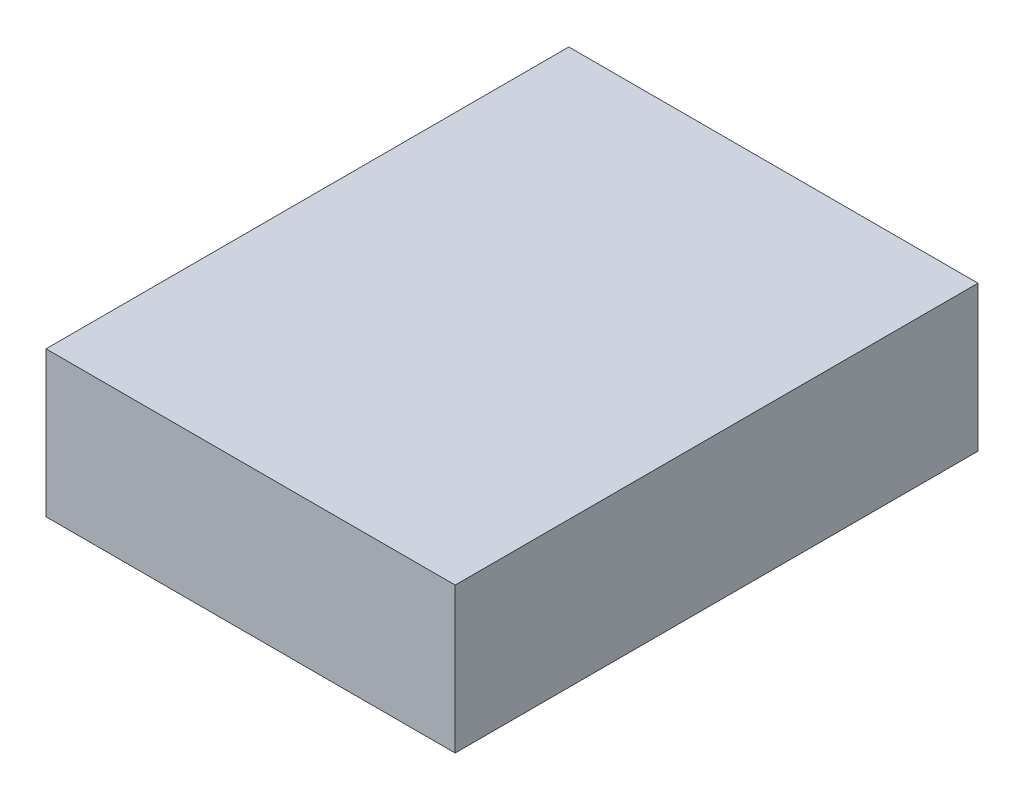
ISO-10303-21;
HEADER;
FILE_DESCRIPTION(('STEP AP214'),'2;1');
FILE_NAME('part.step','',(''),(''),'','','');
FILE_SCHEMA(('AUTOMOTIVE_DESIGN { 1 0 10303 214 1 1 1 1 }'));
ENDSEC;
DATA;
#1=APPLICATION_CONTEXT('core data for automotive mechanical design processes');
#2=APPLICATION_PROTOCOL_DEFINITION('international standard','automotive_design',2000,#1);
#3=PRODUCT_CONTEXT('',#1,'mechanical');
#4=PRODUCT('Part','Part','',(#3));
#5=PRODUCT_RELATED_PRODUCT_CATEGORY('part','',(#4));
#6=PRODUCT_DEFINITION_FORMATION('','',#4);
#7=PRODUCT_DEFINITION_CONTEXT('part definition',#1,'design');
#8=PRODUCT_DEFINITION('design','',#6,#7);
#9=PRODUCT_DEFINITION_SHAPE('','',#8);
#10=(LENGTH_UNIT() NAMED_UNIT(*) SI_UNIT(.MILLI.,.METRE.));
#11=(NAMED_UNIT(*) PLANE_ANGLE_UNIT() SI_UNIT($,.RADIAN.));
#12=(NAMED_UNIT(*) SI_UNIT($,.STERADIAN.) SOLID_ANGLE_UNIT());
#13=UNCERTAINTY_MEASURE_WITH_UNIT(LENGTH_MEASURE(1.E-05),#10,'distance_accuracy_value','');
#14=(GEOMETRIC_REPRESENTATION_CONTEXT(3) GLOBAL_UNCERTAINTY_ASSIGNED_CONTEXT((#13)) GLOBAL_UNIT_ASSIGNED_CONTEXT((#10,
#11,#12)) REPRESENTATION_CONTEXT('',''));
#15=CARTESIAN_POINT('',(0.,0.,0.));
#16=DIRECTION('',(0.,0.,1.));
#17=DIRECTION('',(1.,0.,0.));
#18=AXIS2_PLACEMENT_3D('',#15,#16,#17);
#19=CARTESIAN_POINT('',(45.,32.,57.5));
#20=DIRECTION('',(-1.,0.,0.));
#21=DIRECTION('',(0.,0.,1.));
#22=AXIS2_PLACEMENT_3D('',#19,#20,#21);
#23=PLANE('',#22);
#24=DIRECTION('',(0.,0.,-1.));
#25=VECTOR('',#24,1.);
#26=CARTESIAN_POINT('',(45.,0.,57.5));
#27=LINE('',#26,#25);
#28=CARTESIAN_POINT('',(45.,0.,57.5));
#29=VERTEX_POINT('',#28);
#30=CARTESIAN_POINT('',(45.,0.,-57.5));
#31=VERTEX_POINT('',#30);
#32=EDGE_CURVE('E111',#29,#31,#27,.T.);
#33=ORIENTED_EDGE('',*,*,#32,.T.);
#34=DIRECTION('',(0.,-1.,0.));
#35=VECTOR('',#34,1.);
#36=CARTESIAN_POINT('',(45.,32.,-57.5));
#37=LINE('',#36,#35);
#38=CARTESIAN_POINT('',(45.,32.,-57.5));
#39=VERTEX_POINT('',#38);
#40=EDGE_CURVE('E11',#39,#31,#37,.T.);
#41=ORIENTED_EDGE('',*,*,#40,.F.);
#42=DIRECTION('',(0.,0.,-1.));
#43=VECTOR('',#42,1.);
#44=CARTESIAN_POINT('',(45.,32.,57.5));
#45=LINE('',#44,#43);
#46=CARTESIAN_POINT('',(45.,32.,57.5));
#47=VERTEX_POINT('',#46);
#48=EDGE_CURVE('E95',#47,#39,#45,.T.);
#49=ORIENTED_EDGE('',*,*,#48,.F.);
#50=DIRECTION('',(0.,-1.,0.));
#51=VECTOR('',#50,1.);
#52=CARTESIAN_POINT('',(45.,32.,57.5));
#53=LINE('',#52,#51);
#54=EDGE_CURVE('E107',#47,#29,#53,.T.);
#55=ORIENTED_EDGE('',*,*,#54,.T.);
#56=EDGE_LOOP('',(#33,#41,#49,#55));
#57=FACE_BOUND('',#56,.T.);
#58=ADVANCED_FACE('F43',(#57),#23,.F.);
#59=CARTESIAN_POINT('',(-45.,32.,-57.5));
#60=DIRECTION('',(0.,0.,1.));
#61=DIRECTION('',(1.,0.,0.));
#62=AXIS2_PLACEMENT_3D('',#59,#60,#61);
#63=PLANE('',#62);
#64=DIRECTION('',(-1.,0.,0.));
#65=VECTOR('',#64,1.);
#66=CARTESIAN_POINT('',(-45.,0.,-57.5));
#67=LINE('',#66,#65);
#68=CARTESIAN_POINT('',(-45.,0.,-57.5));
#69=VERTEX_POINT('',#68);
#70=EDGE_CURVE('E100',#31,#69,#67,.T.);
#71=ORIENTED_EDGE('',*,*,#70,.T.);
#72=DIRECTION('',(0.,-1.,0.));
#73=VECTOR('',#72,1.);
#74=CARTESIAN_POINT('',(-45.,32.,-57.5));
#75=LINE('',#74,#73);
#76=CARTESIAN_POINT('',(-45.,32.,-57.5));
#77=VERTEX_POINT('',#76);
#78=EDGE_CURVE('E52',#77,#69,#75,.T.);
#79=ORIENTED_EDGE('',*,*,#78,.F.);
#80=DIRECTION('',(-1.,0.,0.));
#81=VECTOR('',#80,1.);
#82=CARTESIAN_POINT('',(-45.,32.,-57.5));
#83=LINE('',#82,#81);
#84=EDGE_CURVE('E90',#39,#77,#83,.T.);
#85=ORIENTED_EDGE('',*,*,#84,.F.);
#86=ORIENTED_EDGE('',*,*,#40,.T.);
#87=EDGE_LOOP('',(#71,#79,#85,#86));
#88=FACE_BOUND('',#87,.T.);
#89=ADVANCED_FACE('F99',(#88),#63,.F.);
#90=CARTESIAN_POINT('',(-45.,32.,57.5));
#91=DIRECTION('',(1.,0.,0.));
#92=DIRECTION('',(0.,0.,-1.));
#93=AXIS2_PLACEMENT_3D('',#90,#91,#92);
#94=PLANE('',#93);
#95=DIRECTION('',(0.,0.,1.));
#96=VECTOR('',#95,1.);
#97=CARTESIAN_POINT('',(-45.,0.,57.5));
#98=LINE('',#97,#96);
#99=CARTESIAN_POINT('',(-45.,0.,57.5));
#100=VERTEX_POINT('',#99);
#101=EDGE_CURVE('E77',#69,#100,#98,.T.);
#102=ORIENTED_EDGE('',*,*,#101,.T.);
#103=DIRECTION('',(0.,-1.,0.));
#104=VECTOR('',#103,1.);
#105=CARTESIAN_POINT('',(-45.,32.,57.5));
#106=LINE('',#105,#104);
#107=CARTESIAN_POINT('',(-45.,32.,57.5));
#108=VERTEX_POINT('',#107);
#109=EDGE_CURVE('E102',#108,#100,#106,.T.);
#110=ORIENTED_EDGE('',*,*,#109,.F.);
#111=DIRECTION('',(0.,0.,1.));
#112=VECTOR('',#111,1.);
#113=CARTESIAN_POINT('',(-45.,32.,57.5));
#114=LINE('',#113,#112);
#115=EDGE_CURVE('E93',#77,#108,#114,.T.);
#116=ORIENTED_EDGE('',*,*,#115,.F.);
#117=ORIENTED_EDGE('',*,*,#78,.T.);
#118=EDGE_LOOP('',(#102,#110,#116,#117));
#119=FACE_BOUND('',#118,.T.);
#120=ADVANCED_FACE('F103',(#119),#94,.F.);
#121=CARTESIAN_POINT('',(-45.,32.,57.5));
#122=DIRECTION('',(0.,0.,-1.));
#123=DIRECTION('',(-1.,0.,0.));
#124=AXIS2_PLACEMENT_3D('',#121,#122,#123);
#125=PLANE('',#124);
#126=DIRECTION('',(1.,0.,0.));
#127=VECTOR('',#126,1.);
#128=CARTESIAN_POINT('',(-45.,0.,57.5));
#129=LINE('',#128,#127);
#130=EDGE_CURVE('E83',#100,#29,#129,.T.);
#131=ORIENTED_EDGE('',*,*,#130,.T.);
#132=ORIENTED_EDGE('',*,*,#54,.F.);
#133=DIRECTION('',(1.,0.,0.));
#134=VECTOR('',#133,1.);
#135=CARTESIAN_POINT('',(-45.,32.,57.5));
#136=LINE('',#135,#134);
#137=EDGE_CURVE('E60',#108,#47,#136,.T.);
#138=ORIENTED_EDGE('',*,*,#137,.F.);
#139=ORIENTED_EDGE('',*,*,#109,.T.);
#140=EDGE_LOOP('',(#131,#132,#138,#139));
#141=FACE_BOUND('',#140,.T.);
#142=ADVANCED_FACE('F124',(#141),#125,.F.);
#143=CARTESIAN_POINT('',(0.,32.,0.));
#144=DIRECTION('',(0.,-1.,0.));
#145=DIRECTION('',(0.,0.,-1.));
#146=AXIS2_PLACEMENT_3D('',#143,#144,#145);
#147=PLANE('',#146);
#148=ORIENTED_EDGE('',*,*,#48,.T.);
#149=ORIENTED_EDGE('',*,*,#84,.T.);
#150=ORIENTED_EDGE('',*,*,#115,.T.);
#151=ORIENTED_EDGE('',*,*,#137,.T.);
#152=EDGE_LOOP('',(#148,#149,#150,#151));
#153=FACE_BOUND('',#152,.T.);
#154=ADVANCED_FACE('F91',(#153),#147,.F.);
#155=CARTESIAN_POINT('',(0.,0.,0.));
#156=DIRECTION('',(0.,-1.,0.));
#157=DIRECTION('',(0.,0.,-1.));
#158=AXIS2_PLACEMENT_3D('',#155,#156,#157);
#159=PLANE('',#158);
#160=ORIENTED_EDGE('',*,*,#32,.F.);
#161=ORIENTED_EDGE('',*,*,#130,.F.);
#162=ORIENTED_EDGE('',*,*,#101,.F.);
#163=ORIENTED_EDGE('',*,*,#70,.F.);
#164=EDGE_LOOP('',(#160,#161,#162,#163));
#165=FACE_BOUND('',#164,.T.);
#166=ADVANCED_FACE('F127',(#165),#159,.T.);
#167=CLOSED_SHELL('',(#58,#89,#120,#142,#154,#166));
#168=MANIFOLD_SOLID_BREP('B2',#167);
#169=ADVANCED_BREP_SHAPE_REPRESENTATION('',(#18,#168),#14);
#170=SHAPE_DEFINITION_REPRESENTATION(#9,#169);
ENDSEC;
END-ISO-10303-21;
